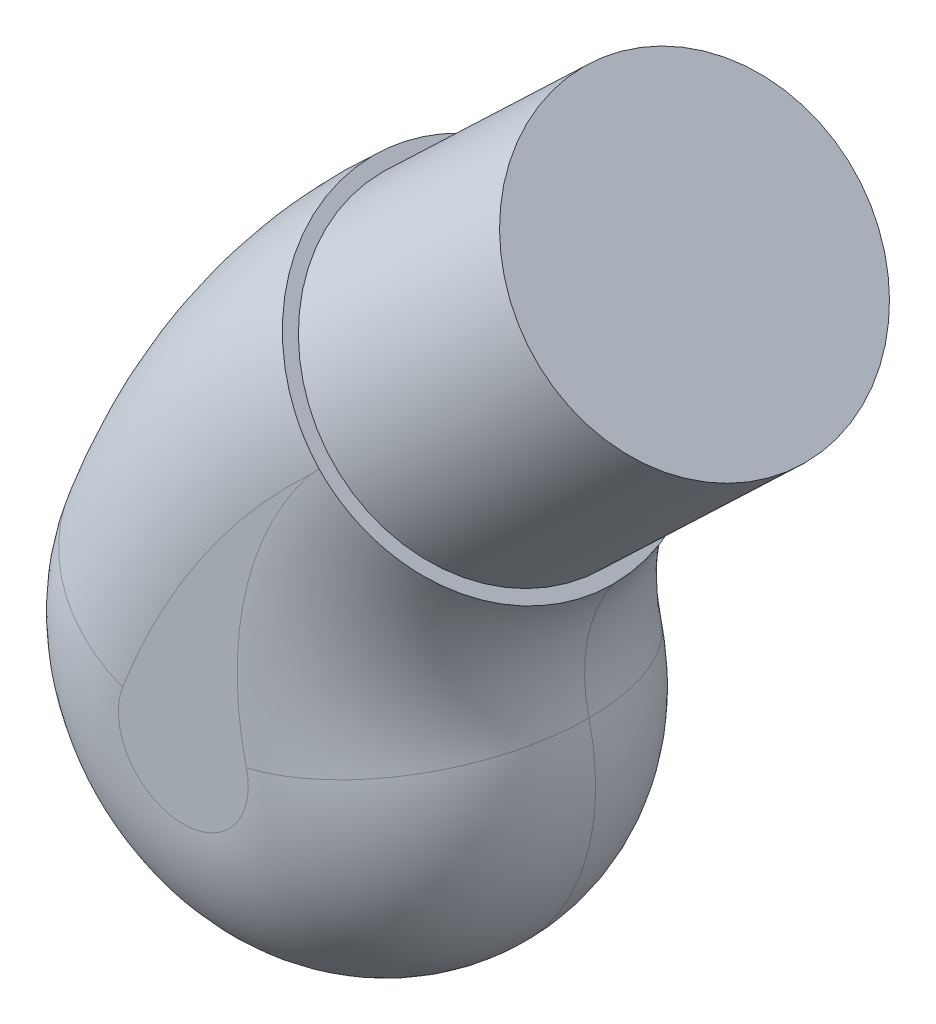
ISO-10303-21;
HEADER;
FILE_DESCRIPTION(('STEP AP214'),'2;1');
FILE_NAME('part.step','',(''),(''),'','','');
FILE_SCHEMA(('AUTOMOTIVE_DESIGN { 1 0 10303 214 1 1 1 1 }'));
ENDSEC;
DATA;
#1=APPLICATION_CONTEXT('core data for automotive mechanical design processes');
#2=APPLICATION_PROTOCOL_DEFINITION('international standard','automotive_design',2000,#1);
#3=PRODUCT_CONTEXT('',#1,'mechanical');
#4=PRODUCT('Part','Part','',(#3));
#5=PRODUCT_RELATED_PRODUCT_CATEGORY('part','',(#4));
#6=PRODUCT_DEFINITION_FORMATION('','',#4);
#7=PRODUCT_DEFINITION_CONTEXT('part definition',#1,'design');
#8=PRODUCT_DEFINITION('design','',#6,#7);
#9=PRODUCT_DEFINITION_SHAPE('','',#8);
#10=(LENGTH_UNIT() NAMED_UNIT(*) SI_UNIT(.MILLI.,.METRE.));
#11=(NAMED_UNIT(*) PLANE_ANGLE_UNIT() SI_UNIT($,.RADIAN.));
#12=(NAMED_UNIT(*) SI_UNIT($,.STERADIAN.) SOLID_ANGLE_UNIT());
#13=UNCERTAINTY_MEASURE_WITH_UNIT(LENGTH_MEASURE(1.E-05),#10,'distance_accuracy_value','');
#14=(GEOMETRIC_REPRESENTATION_CONTEXT(3) GLOBAL_UNCERTAINTY_ASSIGNED_CONTEXT((#13)) GLOBAL_UNIT_ASSIGNED_CONTEXT((#10,
#11,#12)) REPRESENTATION_CONTEXT('',''));
#15=CARTESIAN_POINT('',(0.,0.,0.));
#16=DIRECTION('',(0.,0.,1.));
#17=DIRECTION('',(1.,0.,0.));
#18=AXIS2_PLACEMENT_3D('',#15,#16,#17);
#19=CARTESIAN_POINT('',(16.2818360304692,15.5174485695616,25.));
#20=DIRECTION('',(-0.723895020546298,-0.689910138516804,0.));
#21=DIRECTION('',(0.689910138516804,-0.723895020546298,0.));
#22=AXIS2_PLACEMENT_3D('',#19,#20,#21);
#23=PLANE('',#22);
#24=CARTESIAN_POINT('',(9.82098882165332,22.2965562560012,12.5067721232087));
#25=DIRECTION('',(0.723895020546299,0.689910138516802,0.));
#26=DIRECTION('',(-0.689910138516802,0.723895020546299,0.));
#27=AXIS2_PLACEMENT_3D('',#24,#25,#26);
#28=CIRCLE('',#27,11.55);
#29=CARTESIAN_POINT('',(1.85252672178424,30.657543743311,12.5067721232087));
#30=VERTEX_POINT('',#29);
#31=EDGE_CURVE('E198',#30,#30,#28,.T.);
#32=ORIENTED_EDGE('',*,*,#31,.F.);
#33=EDGE_LOOP('',(#32));
#34=FACE_BOUND('',#33,.T.);
#35=CARTESIAN_POINT('',(1.19158226458532,31.3510462369153,12.5));
#36=CARTESIAN_POINT('',(1.19155614907585,31.3510736388713,12.8514823013509));
#37=CARTESIAN_POINT('',(1.20181211088013,31.3403124697472,13.202959132981));
#38=CARTESIAN_POINT('',(1.24269955032809,31.2974109204485,13.903397714343));
#39=CARTESIAN_POINT('',(1.27333004195232,31.2652715748645,14.2523595849596));
#40=CARTESIAN_POINT('',(1.35474900996919,31.1798419192689,14.9450525040614));
#41=CARTESIAN_POINT('',(1.40552315273876,31.1265666489526,15.2887870919281));
#42=CARTESIAN_POINT('',(1.52685946361283,30.9992533274786,15.9688338039355));
#43=CARTESIAN_POINT('',(1.59742139313367,30.925215526657,16.305146017516));
#44=CARTESIAN_POINT('',(1.75787134724203,30.7568618290644,16.9681184250444));
#45=CARTESIAN_POINT('',(1.84776840669457,30.6625364523721,17.2947740252332));
#46=CARTESIAN_POINT('',(2.04622846562591,30.4543002772282,17.935946757779));
#47=CARTESIAN_POINT('',(2.15479147027562,30.3403894733511,18.2504638867734));
#48=CARTESIAN_POINT('',(2.38978800229275,30.0938170432972,18.8650649451287));
#49=CARTESIAN_POINT('',(2.51621807660243,29.9611590402755,19.1651516483842));
#50=CARTESIAN_POINT('',(2.78606435778774,29.6780201670261,19.7488241339687));
#51=CARTESIAN_POINT('',(2.9294804891943,29.5275393759851,20.0324099896026));
#52=CARTESIAN_POINT('',(3.2323009594664,29.2098020094627,20.5811081361));
#53=CARTESIAN_POINT('',(3.39170759126694,29.0425430280966,20.8462177683284));
#54=CARTESIAN_POINT('',(3.72535822072233,28.6924568128336,21.3560369499197));
#55=CARTESIAN_POINT('',(3.89960224502604,28.5096295509752,21.6007464626412));
#56=CARTESIAN_POINT('',(4.26171591122329,28.129678213551,22.0680638931586));
#57=CARTESIAN_POINT('',(4.44958762738752,27.9325519615363,22.29066843409));
#58=CARTESIAN_POINT('',(4.83759700942788,27.525429288737,22.7121538501087));
#59=CARTESIAN_POINT('',(5.03773467259551,27.3154328707944,22.9110347304344));
#60=CARTESIAN_POINT('',(5.44890582943969,26.8840074772328,23.2837101801678));
#61=CARTESIAN_POINT('',(5.65994210155907,26.6625755863052,23.4574983092501));
#62=CARTESIAN_POINT('',(6.09136266906898,26.209903298791,23.7786951450759));
#63=CARTESIAN_POINT('',(6.31174696652372,25.9786629000384,23.9261038459943));
#64=CARTESIAN_POINT('',(6.7602828637288,25.5080321839555,24.1934887434901));
#65=CARTESIAN_POINT('',(6.98843397662488,25.2686423774618,24.3134666559117));
#66=CARTESIAN_POINT('',(7.45089543988643,24.7834001237832,24.5251523027231));
#67=CARTESIAN_POINT('',(7.68520579135669,24.5375476754391,24.616860032042));
#68=CARTESIAN_POINT('',(8.15841588232898,24.0410273180727,24.771387505279));
#69=CARTESIAN_POINT('',(8.39731741712986,23.7903575253153,24.8341956988477));
#70=CARTESIAN_POINT('',(8.87792107186252,23.2860793982171,24.9304262399403));
#71=CARTESIAN_POINT('',(9.11962319262679,23.0324710630027,24.963848578729));
#72=CARTESIAN_POINT('',(9.60411637431156,22.52411181137,25.0010725187806));
#73=CARTESIAN_POINT('',(9.84690746083831,22.269360868084,25.0048734198244));
#74=CARTESIAN_POINT('',(10.3318480915969,21.7605321260953,24.982827385257));
#75=CARTESIAN_POINT('',(10.5739976357063,21.5064543275212,24.9569804439896));
#76=CARTESIAN_POINT('',(11.0560138002737,21.0006941105409,24.8758102905274));
#77=CARTESIAN_POINT('',(11.2958796506868,20.7490125001119,24.8204774708853));
#78=CARTESIAN_POINT('',(11.7715435032884,20.2499175091434,24.6807234759513));
#79=CARTESIAN_POINT('',(12.0073415044424,20.0025041296892,24.5963022932622));
#80=CARTESIAN_POINT('',(12.4731949430107,19.5137028124497,24.3989710309027));
#81=CARTESIAN_POINT('',(12.7032503503597,19.2723149062105,24.2860608021129));
#82=CARTESIAN_POINT('',(13.1559819733324,18.7972817834645,24.0325534571535));
#83=CARTESIAN_POINT('',(13.3786581892267,18.5636365666737,23.8919563419998));
#84=CARTESIAN_POINT('',(13.8150843421415,18.1057121192805,23.5840476302819));
#85=CARTESIAN_POINT('',(14.0288327953895,17.8814344455412,23.416731615213));
#86=CARTESIAN_POINT('',(14.445843558834,17.4438817871317,23.0565893872942));
#87=CARTESIAN_POINT('',(14.649105862398,17.2306068094208,22.8637631583092));
#88=CARTESIAN_POINT('',(15.0436808781706,16.8165950806414,22.4539863590969));
#89=CARTESIAN_POINT('',(15.2349945755217,16.6158572959025,22.2370377818282));
#90=CARTESIAN_POINT('',(15.6043275854488,16.2283309908327,21.7805439888965));
#91=CARTESIAN_POINT('',(15.7823469332807,16.0415424335092,21.5409988331625));
#92=CARTESIAN_POINT('',(16.1237467428299,15.6833253145676,21.0411239866061));
#93=CARTESIAN_POINT('',(16.2871336919633,15.5118899459641,20.7808036044664));
#94=CARTESIAN_POINT('',(16.5981946880996,15.185506126365,20.2411306993917));
#95=CARTESIAN_POINT('',(16.7458685904034,15.0305578271964,19.9617780012299));
#96=CARTESIAN_POINT('',(17.0245138450769,14.7381865441904,19.3858908340159));
#97=CARTESIAN_POINT('',(17.1554772904137,14.6007718568853,19.0893483269162));
#98=CARTESIAN_POINT('',(17.3996792278314,14.3445405643804,18.4813218489858));
#99=CARTESIAN_POINT('',(17.5129183883525,14.225723257813,18.169838442204));
#100=CARTESIAN_POINT('',(17.7208873354223,14.0075097879606,17.5340771954524));
#101=CARTESIAN_POINT('',(17.8156135658658,13.9081173559541,17.2097969117107));
#102=CARTESIAN_POINT('',(17.9858501071591,13.7294949851883,16.5508067800394));
#103=CARTESIAN_POINT('',(18.0613606384591,13.6502648151195,16.2160970518099));
#104=CARTESIAN_POINT('',(18.1925093830334,13.512655700761,15.5392465197758));
#105=CARTESIAN_POINT('',(18.24818226595,13.454240379007,15.1971197999665));
#106=CARTESIAN_POINT('',(18.3394186488853,13.3585097039345,14.5074305107202));
#107=CARTESIAN_POINT('',(18.3749941328834,13.3211817763075,14.159871307991));
#108=CARTESIAN_POINT('',(18.4095033462526,13.2849726436592,13.6859433008726));
#109=CARTESIAN_POINT('',(18.4172977061036,13.2767943346745,13.5608326640299));
#110=CARTESIAN_POINT('',(18.4302718813521,13.263181053272,13.3104729400395));
#111=CARTESIAN_POINT('',(18.435454721388,13.2577429072225,13.1852241822156));
#112=CARTESIAN_POINT('',(18.4393357275054,13.2536707232579,13.05987665076));
#113=B_SPLINE_CURVE_WITH_KNOTS('',3,(#35,#36,#37,#38,#39,#40,#41,#42,#43,#44,#45,#46,#47,#48,
#49,#50,#51,#52,#53,#54,#55,#56,#57,#58,#59,#60,#61,#62,#63,#64,#65,#66,#67,#68,#69,#70,#71,#72,
#73,#74,#75,#76,#77,#78,#79,#80,#81,#82,#83,#84,#85,#86,#87,#88,#89,#90,#91,#92,#93,#94,#95,#96,
#97,#98,#99,#100,#101,#102,#103,#104,#105,#106,#107,#108,#109,#110,#111,#112),.UNSPECIFIED.,.F.,
.F.,(4,2,2,2,2,2,2,2,2,2,2,2,2,2,2,2,2,2,2,2,2,2,2,2,2,2,2,2,2,2,2,2,2,2,2,2,2,2,4),(0.,
1.05412495344784,2.10819889653658,3.16152413337613,4.21483667069503,5.26864247040714,
6.3224485620492,7.37605126893912,8.42964929484609,9.48339861649045,10.537149830773,
11.5910617744351,12.6449734853792,13.6991552151206,14.7533371776452,15.8074531811747,
16.8615693737814,17.9161065024625,18.9706439446195,20.0252063148444,21.0797688862644,
22.1346752783751,23.1895819387524,24.2444941209111,25.2994062643596,26.3544930396395,
27.4095804822577,28.4645808195372,29.5195783589074,30.5741058149899,31.6286429812125,
32.683677296012,33.7386718124501,34.793868781553,35.8490536444759,36.9023852426792,
37.9550880796935,38.3319041947086,38.7082828757795),.UNSPECIFIED.);
#114=CARTESIAN_POINT('',(1.19158226458532,31.3510462369153,12.5));
#115=VERTEX_POINT('',#114);
#116=CARTESIAN_POINT('',(9.77636140606287,22.3433820121723,24.9998489996241));
#117=VERTEX_POINT('',#116);
#118=EDGE_CURVE('E163',#115,#117,#113,.T.);
#119=ORIENTED_EDGE('',*,*,#118,.T.);
#120=CARTESIAN_POINT('',(1.19158226458532,31.3510462369153,14.4608128362231));
#121=CARTESIAN_POINT('',(1.22963312058225,31.3111210007927,14.8076279329357));
#122=CARTESIAN_POINT('',(1.27783549803078,31.2605441806165,15.1520954516926));
#123=CARTESIAN_POINT('',(1.39408198325015,31.1385714089346,15.8339050022062));
#124=CARTESIAN_POINT('',(1.4621250472861,31.0671765525781,16.1712474077842));
#125=CARTESIAN_POINT('',(1.61753648751098,30.9041095653954,16.8361600891158));
#126=CARTESIAN_POINT('',(1.70489010570087,30.8124529195454,17.1637376118315));
#127=CARTESIAN_POINT('',(1.89831778170809,30.6094970218418,17.8070622881988));
#128=CARTESIAN_POINT('',(2.00439163088618,30.498197988905,18.1228095736523));
#129=CARTESIAN_POINT('',(2.23455499230695,30.2566968107909,18.740375682363));
#130=CARTESIAN_POINT('',(2.35865252328182,30.1264862518797,19.0421882268762));
#131=CARTESIAN_POINT('',(2.62393941602325,29.8481313619449,19.6295960305236));
#132=CARTESIAN_POINT('',(2.76512879993069,29.6999870076898,19.9151912686493));
#133=CARTESIAN_POINT('',(3.06356285370042,29.3868521319656,20.4680934550989));
#134=CARTESIAN_POINT('',(3.22080460050984,29.2218646775385,20.7354037182702));
#135=CARTESIAN_POINT('',(3.5502414199839,28.8761998439783,21.2499059539985));
#136=CARTESIAN_POINT('',(3.72243643763683,28.6955225225669,21.4970980005621));
#137=CARTESIAN_POINT('',(4.08072918105483,28.3195803260719,21.9698587122783));
#138=CARTESIAN_POINT('',(4.26684043061309,28.1243012610149,22.1954058439583));
#139=CARTESIAN_POINT('',(4.65148896456746,27.7207049912332,22.6230166518878));
#140=CARTESIAN_POINT('',(4.85002627403176,27.5123877602053,22.8250802807595));
#141=CARTESIAN_POINT('',(5.25814398379019,27.0841662261284,23.2043392051764));
#142=CARTESIAN_POINT('',(5.46772605768128,26.8642601670412,23.3815307168968));
#143=CARTESIAN_POINT('',(5.89641571424266,26.414453314787,23.7097762298627));
#144=CARTESIAN_POINT('',(6.11552330900223,26.1845525089352,23.8608301979346));
#145=CARTESIAN_POINT('',(6.56222209857735,25.7158493961608,24.1360727603708));
#146=CARTESIAN_POINT('',(6.78983160559293,25.4770278749815,24.2601989164267));
#147=CARTESIAN_POINT('',(7.25144058206897,24.9926801014746,24.4802926299959));
#148=CARTESIAN_POINT('',(7.48544005916671,24.7471538411334,24.5762601538523));
#149=CARTESIAN_POINT('',(7.95815907470119,24.2511487495158,24.7393836555708));
#150=CARTESIAN_POINT('',(8.1968783927472,24.0006701494865,24.8065409754034));
#151=CARTESIAN_POINT('',(8.67736080620213,23.4965192359953,24.911608696418));
#152=CARTESIAN_POINT('',(8.91912390876368,23.2428469150284,24.9495190288589));
#153=CARTESIAN_POINT('',(9.40485472445677,22.7331890637,24.9959418286602));
#154=CARTESIAN_POINT('',(9.648827222487,22.4771985127364,25.0043491288229));
#155=CARTESIAN_POINT('',(10.136397545968,21.9656105397102,24.9914485439027));
#156=CARTESIAN_POINT('',(10.3799953706506,21.7100131184536,24.9701405979838));
#157=CARTESIAN_POINT('',(10.8651050673945,21.2010069823116,24.8979944651177));
#158=CARTESIAN_POINT('',(11.1066168970682,20.9475983119018,24.847155679528));
#159=CARTESIAN_POINT('',(11.5858544416547,20.4447535893545,24.7163395116606));
#160=CARTESIAN_POINT('',(11.8235801454401,20.1953175488927,24.63636204376));
#161=CARTESIAN_POINT('',(12.2946409978582,19.7010523012869,24.4474364641707));
#162=CARTESIAN_POINT('',(12.5279515534988,19.4562488985826,24.3383595109169));
#163=CARTESIAN_POINT('',(12.9874312784763,18.974135263221,24.0921999581167));
#164=CARTESIAN_POINT('',(13.2136004245562,18.7368250549663,23.9551172673769));
#165=CARTESIAN_POINT('',(13.6572219578149,18.2713507837467,23.6539236505601));
#166=CARTESIAN_POINT('',(13.8746737673915,18.0431873268366,23.4898109371682));
#167=CARTESIAN_POINT('',(14.2993161745179,17.5976270909884,23.1357308529824));
#168=CARTESIAN_POINT('',(14.5065067527111,17.3802303323605,22.9457634334191));
#169=CARTESIAN_POINT('',(14.9099525295986,16.9569108699488,22.5405208181359));
#170=CARTESIAN_POINT('',(15.1061619084207,16.7510362431181,22.3251497725357));
#171=CARTESIAN_POINT('',(15.4853660106244,16.3531525970739,21.8712111557262));
#172=CARTESIAN_POINT('',(15.6683606557412,16.1611436599803,21.6326434471533));
#173=CARTESIAN_POINT('',(16.0198112390089,15.7923806675382,21.1339812655644));
#174=CARTESIAN_POINT('',(16.1882672687107,15.6156265161291,20.8738869281238));
#175=CARTESIAN_POINT('',(16.5094029282019,15.2786717565928,20.3339850838045));
#176=CARTESIAN_POINT('',(16.6620827285437,15.118470969512,20.0541777900919));
#177=CARTESIAN_POINT('',(16.9503153208172,14.8160400779259,19.4772094970351));
#178=CARTESIAN_POINT('',(17.0858921213738,14.673784782134,19.1800736999561));
#179=CARTESIAN_POINT('',(17.3391228398796,14.4080799519806,18.5701688355739));
#180=CARTESIAN_POINT('',(17.4567770609954,14.2846300995185,18.2574000328273));
#181=CARTESIAN_POINT('',(17.6731929689844,14.0575535725711,17.6185264393359));
#182=CARTESIAN_POINT('',(17.7719598282548,13.9539214708969,17.2924253294878));
#183=CARTESIAN_POINT('',(17.9498100326706,13.7673103889717,16.6291625235563));
#184=CARTESIAN_POINT('',(18.0288961037257,13.6843285485332,16.2920023665484));
#185=CARTESIAN_POINT('',(18.1542653171733,13.552783664239,15.6707586919948));
#186=CARTESIAN_POINT('',(18.2038928867224,13.5007114471882,15.3880819048889));
#187=CARTESIAN_POINT('',(18.2891853678616,13.4112174697271,14.8183654142482));
#188=CARTESIAN_POINT('',(18.3248522893102,13.3737936004527,14.5313263449193));
#189=CARTESIAN_POINT('',(18.3820004033152,13.3138303779223,13.9543420280172));
#190=CARTESIAN_POINT('',(18.403483705482,13.2912888111367,13.6643972191466));
#191=CARTESIAN_POINT('',(18.4321606602322,13.2611992333945,13.0829704830006));
#192=CARTESIAN_POINT('',(18.4393515189933,13.2536541538834,12.7914882663624));
#193=CARTESIAN_POINT('',(18.4393357275054,13.2536707232579,12.5));
#194=B_SPLINE_CURVE_WITH_KNOTS('',3,(#120,#121,#122,#123,#124,#125,#126,#127,#128,#129,#130,
#131,#132,#133,#134,#135,#136,#137,#138,#139,#140,#141,#142,#143,#144,#145,#146,#147,#148,#149,
#150,#151,#152,#153,#154,#155,#156,#157,#158,#159,#160,#161,#162,#163,#164,#165,#166,#167,#168,
#169,#170,#171,#172,#173,#174,#175,#176,#177,#178,#179,#180,#181,#182,#183,#184,#185,#186,#187,
#188,#189,#190,#191,#192,#193),.UNSPECIFIED.,.F.,.F.,(4,2,2,2,2,2,2,2,2,2,2,2,2,2,2,2,2,2,2,2,2,
2,2,2,2,2,2,2,2,2,2,2,2,2,2,2,4),(0.,1.05319682864208,2.10633826303122,3.15867760463274,
4.21100521852615,5.26380245510958,6.31660105550673,7.36920828748659,8.42181164718571,
9.47545156460011,10.5290936076834,11.5828957692593,12.6366992683044,13.6929207366826,
14.7491434675114,15.8053169944599,16.8614930037883,17.9214300797273,18.9813693256796,
20.0413300592353,21.1012939074681,22.1660310903261,23.230771740275,24.2955828226955,
25.3603959136881,26.4293635168191,27.4983374504288,28.5673046521252,29.6362602963202,
30.7036982708974,31.771118187378,32.8382453657071,33.9052246580217,34.7795784147395,
35.6538062479075,36.5279040228859,37.4021726457481),.UNSPECIFIED.);
#195=CARTESIAN_POINT('',(18.4393357275054,13.2536707232579,12.5));
#196=VERTEX_POINT('',#195);
#197=EDGE_CURVE('E127',#117,#196,#194,.T.);
#198=ORIENTED_EDGE('',*,*,#197,.T.);
#199=CARTESIAN_POINT('',(18.4393357275054,13.2536707232579,12.5));
#200=CARTESIAN_POINT('',(18.4393679372597,13.2536369268553,12.1525684663161));
#201=CARTESIAN_POINT('',(18.4291427961295,13.2643657570831,11.8051477113368));
#202=CARTESIAN_POINT('',(18.3884136224962,13.3071012444141,11.1128534254182));
#203=CARTESIAN_POINT('',(18.3579120591671,13.3391053107122,10.767979589496));
#204=CARTESIAN_POINT('',(18.2769233115255,13.4240835533338,10.083705373054));
#205=CARTESIAN_POINT('',(18.2264645797861,13.4770278755144,9.74429791305932));
#206=CARTESIAN_POINT('',(18.1060065391726,13.6034196632511,9.07285023198808));
#207=CARTESIAN_POINT('',(18.0360071388313,13.6768672247803,8.74081004540467));
#208=CARTESIAN_POINT('',(17.8770441132115,13.8436607479839,8.08638564000919));
#209=CARTESIAN_POINT('',(17.7880791431626,13.9370081206721,7.76400210776037));
#210=CARTESIAN_POINT('',(17.5919023260516,14.142848581806,7.13111703928463));
#211=CARTESIAN_POINT('',(17.4846902154165,14.2553419468084,6.82061567477047));
#212=CARTESIAN_POINT('',(17.2528421520192,14.4986108150953,6.21357766823182));
#213=CARTESIAN_POINT('',(17.1282053094822,14.6293872519847,5.91704174037141));
#214=CARTESIAN_POINT('',(16.8624402844391,14.908243826955,5.33992773157713));
#215=CARTESIAN_POINT('',(16.7213119968434,15.0563240753021,5.05934975235002));
#216=CARTESIAN_POINT('',(16.4215854599097,15.3708151017398,4.51236635712545));
#217=CARTESIAN_POINT('',(16.2627784582962,15.5374449152152,4.24620122737484));
#218=CARTESIAN_POINT('',(15.9304193015582,15.8861760399858,3.73397140970524));
#219=CARTESIAN_POINT('',(15.7568670132248,16.0682774910517,3.4879069034147));
#220=CARTESIAN_POINT('',(15.396220960537,16.4466889205194,3.01751599273859));
#221=CARTESIAN_POINT('',(15.2091252694495,16.6430009205648,2.79319269199391));
#222=CARTESIAN_POINT('',(14.8227219713781,17.0484383939116,2.36785380008164));
#223=CARTESIAN_POINT('',(14.6234142974186,17.2575639374876,2.16683833676114));
#224=CARTESIAN_POINT('',(14.2114557608266,17.6898154970191,1.78718146239472));
#225=CARTESIAN_POINT('',(13.9986712497022,17.9130817449736,1.60884463097857));
#226=CARTESIAN_POINT('',(13.5635082121835,18.3696808560734,1.27873714409891));
#227=CARTESIAN_POINT('',(13.3411295995799,18.6030138096749,1.12696672741446));
#228=CARTESIAN_POINT('',(12.8883575443442,19.0780893563718,0.851088817572766));
#229=CARTESIAN_POINT('',(12.657964360019,19.3198316784363,0.726980433831228));
#230=CARTESIAN_POINT('',(12.1907861128835,19.8100230641376,0.507325860271062));
#231=CARTESIAN_POINT('',(11.954001063349,20.0584721138448,0.411779611134693));
#232=CARTESIAN_POINT('',(11.4754302131114,20.5606173007677,0.249861756377551));
#233=CARTESIAN_POINT('',(11.2336387722289,20.8143193559975,0.183525166922723));
#234=CARTESIAN_POINT('',(10.7470524292821,21.3248748777388,0.0807015781429287));
#235=CARTESIAN_POINT('',(10.5022575210911,21.5817283506787,0.0442146397176756));
#236=CARTESIAN_POINT('',(10.0114172270143,22.0967473726191,0.0013880543374006));
#237=CARTESIAN_POINT('',(9.76537185226245,22.3549129099371,-0.00495186057533866));
#238=CARTESIAN_POINT('',(9.27379468395401,22.8707051044362,0.0125968815293924));
#239=CARTESIAN_POINT('',(9.02826288848736,23.1283317636214,0.0364854259224638));
#240=CARTESIAN_POINT('',(8.54046055929187,23.6401631709329,0.114198143220243));
#241=CARTESIAN_POINT('',(8.29818090085926,23.8943774932446,0.167902001498461));
#242=CARTESIAN_POINT('',(7.81762138605429,24.3986093060881,0.304809713667848));
#243=CARTESIAN_POINT('',(7.57934152182879,24.6486268048599,0.388013509632179));
#244=CARTESIAN_POINT('',(7.10848977799699,25.1426726432181,0.583357563219642));
#245=CARTESIAN_POINT('',(6.8759180245904,25.3867008503883,0.695498459978585));
#246=CARTESIAN_POINT('',(6.41816558057074,25.8670021191609,0.94793816269134));
#247=CARTESIAN_POINT('',(6.19298486616554,26.1032752057276,1.08823687799337));
#248=CARTESIAN_POINT('',(5.75263204975267,26.5653197435425,1.39531701450698));
#249=CARTESIAN_POINT('',(5.5374196206914,26.7911335083496,1.56197694979129));
#250=CARTESIAN_POINT('',(5.1174786125394,27.2317607549328,1.92105744405334));
#251=CARTESIAN_POINT('',(4.91275002146667,27.4465742492809,2.11347797358841));
#252=CARTESIAN_POINT('',(4.51526760522242,27.863636596694,2.5227033775691));
#253=CARTESIAN_POINT('',(4.32251274820611,28.0658865324323,2.73950614632058));
#254=CARTESIAN_POINT('',(3.95034963412969,28.4563823522069,3.19597015403526));
#255=CARTESIAN_POINT('',(3.77094125675984,28.6446283624794,3.43563118690179));
#256=CARTESIAN_POINT('',(3.42735063412103,29.0051442136732,3.935254563248));
#257=CARTESIAN_POINT('',(3.26311869266086,29.1774661988136,4.19514510974994));
#258=CARTESIAN_POINT('',(2.95037072792042,29.5056200868667,4.73410041589955));
#259=CARTESIAN_POINT('',(2.80185511056662,29.6614515638572,5.0131656704911));
#260=CARTESIAN_POINT('',(2.52162246969408,29.9554884274961,5.58845769103546));
#261=CARTESIAN_POINT('',(2.3899044415055,30.0936948683043,5.88468342907098));
#262=CARTESIAN_POINT('',(2.14421320601066,30.3514888215124,6.49218536889043));
#263=CARTESIAN_POINT('',(2.03023808124605,30.4710783458244,6.80345993959012));
#264=CARTESIAN_POINT('',(1.83649937769765,30.6743605922446,7.39132918321441));
#265=CARTESIAN_POINT('',(1.75416855294711,30.7607470225158,7.66615463341113));
#266=CARTESIAN_POINT('',(1.60335709905028,30.9189874286533,8.22365195634443));
#267=CARTESIAN_POINT('',(1.53487489398015,30.9908430580732,8.50632293211993));
#268=CARTESIAN_POINT('',(1.41214285189247,31.1196208642955,9.07793990446745));
#269=CARTESIAN_POINT('',(1.35788657503851,31.1765497981599,9.36688299739402));
#270=CARTESIAN_POINT('',(1.26382499083111,31.2752448435448,9.94971177664054));
#271=CARTESIAN_POINT('',(1.22402171308351,31.3170088254814,10.2435981510773));
#272=CARTESIAN_POINT('',(1.19158226458532,31.3510462369153,10.5391871637769));
#273=B_SPLINE_CURVE_WITH_KNOTS('',3,(#199,#200,#201,#202,#203,#204,#205,#206,#207,#208,#209,
#210,#211,#212,#213,#214,#215,#216,#217,#218,#219,#220,#221,#222,#223,#224,#225,#226,#227,#228,
#229,#230,#231,#232,#233,#234,#235,#236,#237,#238,#239,#240,#241,#242,#243,#244,#245,#246,#247,
#248,#249,#250,#251,#252,#253,#254,#255,#256,#257,#258,#259,#260,#261,#262,#263,#264,#265,#266,
#267,#268,#269,#270,#271,#272),.UNSPECIFIED.,.F.,.F.,(4,2,2,2,2,2,2,2,2,2,2,2,2,2,2,2,2,2,2,2,2,
2,2,2,2,2,2,2,2,2,2,2,2,2,2,2,4),(0.,1.041962396169,2.08379792996248,3.12415346103015,
4.16451386194755,5.2049480550845,6.2453972781734,7.28589965007693,8.32640865280005,
9.38086015562246,10.4353211853731,11.4899325224664,12.5445496439932,13.6120986734173,
14.6796572974843,15.7471815463366,16.8147035781428,17.8835018805711,18.9523023635726,
20.0210933466686,21.089880347703,22.1543854639573,23.2188884899335,24.2834150296768,
25.3479381423193,26.4076911340493,27.4674429145606,28.5271032431764,29.5867540184933,
30.6428018826005,31.6988770160103,32.7548889555325,33.8107866935264,34.7088855489713,
35.6068821463656,36.5044715313455,37.4021869143106),.UNSPECIFIED.);
#274=CARTESIAN_POINT('',(9.77636140606292,22.3433820121722,0.000151000375869332));
#275=VERTEX_POINT('',#274);
#276=EDGE_CURVE('E155',#196,#275,#273,.T.);
#277=ORIENTED_EDGE('',*,*,#276,.T.);
#278=CARTESIAN_POINT('',(18.4393357275054,13.2536707232579,11.94012334924));
#279=CARTESIAN_POINT('',(18.4284944676654,13.2650460221214,11.5890744612896));
#280=CARTESIAN_POINT('',(18.4073811147155,13.2871994160407,11.2386993101655));
#281=CARTESIAN_POINT('',(18.3448775946649,13.352781851209,10.5417866271086));
#282=CARTESIAN_POINT('',(18.3034884476609,13.3962098221116,10.1952489030077));
#283=CARTESIAN_POINT('',(18.2007371077466,13.5040226794183,9.50871622885647));
#284=CARTESIAN_POINT('',(18.1393895259973,13.5683922349177,9.1687166846051));
#285=CARTESIAN_POINT('',(17.9971604408583,13.7176275059493,8.49741748931225));
#286=CARTESIAN_POINT('',(17.9162791645745,13.8024929831884,8.16611773717337));
#287=CARTESIAN_POINT('',(17.7355162140396,13.9921602927206,7.51441704876799));
#288=CARTESIAN_POINT('',(17.6356258537195,14.0969712389573,7.1940211741586));
#289=CARTESIAN_POINT('',(17.4175825900606,14.3257552848994,6.56656260555516));
#290=CARTESIAN_POINT('',(17.2994296744976,14.4497283974311,6.25949992048597));
#291=CARTESIAN_POINT('',(17.0457277507463,14.715927644338,5.66094291346942));
#292=CARTESIAN_POINT('',(16.9101819937012,14.8581503674191,5.36944569634365));
#293=CARTESIAN_POINT('',(16.6226434458778,15.1598530260175,4.80402555892429));
#294=CARTESIAN_POINT('',(16.4706507231448,15.3193328901375,4.53010256592913));
#295=CARTESIAN_POINT('',(16.1512237839642,15.6544947580269,4.00164510922312));
#296=CARTESIAN_POINT('',(15.9837822963696,15.8301843911191,3.74711987927379));
#297=CARTESIAN_POINT('',(15.6347101784225,16.196451755354,3.25940506104717));
#298=CARTESIAN_POINT('',(15.4530795199539,16.3870295159978,3.02621551504899));
#299=CARTESIAN_POINT('',(15.0768919180214,16.7817480693671,2.58279062420639));
#300=CARTESIAN_POINT('',(14.8823329977328,16.9858909362955,2.37255880281563));
#301=CARTESIAN_POINT('',(14.4816966255971,17.4062626030494,1.97657992301083));
#302=CARTESIAN_POINT('',(14.2756191737322,17.6224914028936,1.79083286463487));
#303=CARTESIAN_POINT('',(13.8532736180893,18.0656416446585,1.44502808661273));
#304=CARTESIAN_POINT('',(13.636999049561,18.2925698697822,1.28498695512156));
#305=CARTESIAN_POINT('',(13.1959194976519,18.7553769419876,0.991873619178664));
#306=CARTESIAN_POINT('',(12.9711145098804,18.9912557936763,0.858801428608712));
#307=CARTESIAN_POINT('',(12.5145858326179,19.4702730131035,0.62057757414059));
#308=CARTESIAN_POINT('',(12.2828625720039,19.7134109308384,0.515424183483653));
#309=CARTESIAN_POINT('',(11.8141302242141,20.2052329719865,0.333773495451645));
#310=CARTESIAN_POINT('',(11.5771211367468,20.4539170957052,0.25727619965574));
#311=CARTESIAN_POINT('',(11.0994092199377,20.9551610382529,0.133457559932921));
#312=CARTESIAN_POINT('',(10.8587050128426,21.2077223027029,0.0861473834441182));
#313=CARTESIAN_POINT('',(10.3754025186261,21.7148322137604,0.0210861545409315));
#314=CARTESIAN_POINT('',(10.1328042308417,21.9693808610636,0.00333511247310873));
#315=CARTESIAN_POINT('',(9.64743292373479,22.4786614944604,-0.00248030601635474));
#316=CARTESIAN_POINT('',(9.40465990065151,22.7333934845001,0.00945597685274066));
#317=CARTESIAN_POINT('',(8.92067084141128,23.2412237806835,0.0629335858059693));
#318=CARTESIAN_POINT('',(8.67945480504473,23.4943220870471,0.104474907904692));
#319=CARTESIAN_POINT('',(8.20030820477233,23.9970713853753,0.216866368010261));
#320=CARTESIAN_POINT('',(7.96237746458555,24.2467225623045,0.287714927097899));
#321=CARTESIAN_POINT('',(7.49148067245671,24.7408156680329,0.458219357219408));
#322=CARTESIAN_POINT('',(7.25851462067285,24.9852575966662,0.557875229171309));
#323=CARTESIAN_POINT('',(6.79920420480246,25.4671935827765,0.785288382880253));
#324=CARTESIAN_POINT('',(6.57285986052003,25.704687619474,0.913045748673109));
#325=CARTESIAN_POINT('',(6.12840470022689,26.1710365820853,1.19575542998298));
#326=CARTESIAN_POINT('',(5.91029388172936,26.3998915106084,1.35070773728608));
#327=CARTESIAN_POINT('',(5.48391471007393,26.8472740637762,1.68666313952292));
#328=CARTESIAN_POINT('',(5.27564378787778,27.0658043840097,1.86765938431871));
#329=CARTESIAN_POINT('',(4.8703657402006,27.4910463746274,2.25444814123308));
#330=CARTESIAN_POINT('',(4.67335861830332,27.6977580412514,2.46024066124093));
#331=CARTESIAN_POINT('',(4.29202710818951,28.0978738910376,2.89514174855627));
#332=CARTESIAN_POINT('',(4.10770165958261,28.2912791868249,3.12424836245221));
#333=CARTESIAN_POINT('',(3.75302855151629,28.6634234452103,3.60416331422069));
#334=CARTESIAN_POINT('',(3.58268085522996,28.8421624464494,3.8549715949127));
#335=CARTESIAN_POINT('',(3.2572695973617,29.1836034197723,4.37635770885568));
#336=CARTESIAN_POINT('',(3.10219733378096,29.3463145225143,4.64692413164631));
#337=CARTESIAN_POINT('',(2.80832855332304,29.6546592401681,5.20603374890652));
#338=CARTESIAN_POINT('',(2.66953218370632,29.8002927005655,5.49457710599103));
#339=CARTESIAN_POINT('',(2.40914350171506,30.0735080945375,6.08772783239352));
#340=CARTESIAN_POINT('',(2.28755933735272,30.2010814787298,6.3923427167051));
#341=CARTESIAN_POINT('',(2.06254366129792,30.4371813971787,7.01533276862145));
#342=CARTESIAN_POINT('',(1.95911147161311,30.5457086428255,7.33370742173286));
#343=CARTESIAN_POINT('',(1.77108505245258,30.7429972184857,7.98212063594642));
#344=CARTESIAN_POINT('',(1.68650014365371,30.8317487686868,8.31216487502231));
#345=CARTESIAN_POINT('',(1.53683773494229,30.9887835278253,8.98141885434595));
#346=CARTESIAN_POINT('',(1.47176002125406,31.0570669610688,9.32062849410739));
#347=CARTESIAN_POINT('',(1.36167206593362,31.1725778344847,10.0051787927733));
#348=CARTESIAN_POINT('',(1.31662688190057,31.219841938316,10.3505076748497));
#349=CARTESIAN_POINT('',(1.24677747299156,31.2931321198548,11.045288949007));
#350=CARTESIAN_POINT('',(1.22196120592822,31.3191708329462,11.3947387620281));
#351=CARTESIAN_POINT('',(1.20208055026666,31.340030807072,11.870739020919));
#352=CARTESIAN_POINT('',(1.19814154212149,31.3441638502366,11.9966073111864));
#353=CARTESIAN_POINT('',(1.19289421962895,31.34966965514,12.2483124464887));
#354=CARTESIAN_POINT('',(1.1915828491718,31.3510456235322,12.3741491576553));
#355=CARTESIAN_POINT('',(1.19158226458532,31.3510462369153,12.5));
#356=B_SPLINE_CURVE_WITH_KNOTS('',3,(#278,#279,#280,#281,#282,#283,#284,#285,#286,#287,#288,
#289,#290,#291,#292,#293,#294,#295,#296,#297,#298,#299,#300,#301,#302,#303,#304,#305,#306,#307,
#308,#309,#310,#311,#312,#313,#314,#315,#316,#317,#318,#319,#320,#321,#322,#323,#324,#325,#326,
#327,#328,#329,#330,#331,#332,#333,#334,#335,#336,#337,#338,#339,#340,#341,#342,#343,#344,#345,
#346,#347,#348,#349,#350,#351,#352,#353,#354,#355),.UNSPECIFIED.,.F.,.F.,(4,2,2,2,2,2,2,2,2,2,2,
2,2,2,2,2,2,2,2,2,2,2,2,2,2,2,2,2,2,2,2,2,2,2,2,2,2,2,4),(0.,1.05387893173111,2.10770484714558,
3.16076100772694,4.2138049256751,5.26733118518026,6.32085814987701,7.37418847097391,
8.42751443434079,9.48133871216866,10.535165078225,11.5891529544189,12.643140832252,
13.6978061443426,14.7524719993014,15.8070726086917,16.8616732761984,17.9166772001994,
18.9716814934825,20.0267092163191,21.0817367971286,22.136707546023,23.1916783285371,
24.2466522659201,25.3016258846616,26.3563225272495,27.4110195054044,28.4656281866019,
29.520234089154,30.5742356941587,31.6282468347866,32.6827552726202,33.7372243152423,
34.7922136800671,35.847191483039,36.9003218185767,37.9528247713681,38.3307745248821,
38.708284443042),.UNSPECIFIED.);
#357=EDGE_CURVE('E184',#275,#115,#356,.T.);
#358=ORIENTED_EDGE('',*,*,#357,.T.);
#359=EDGE_LOOP('',(#119,#198,#277,#358));
#360=FACE_BOUND('',#359,.T.);
#361=ADVANCED_FACE('F55',(#34,#360),#23,.F.);
#362=CARTESIAN_POINT('',(0.,0.,0.));
#363=DIRECTION('',(0.,0.,1.));
#364=DIRECTION('',(1.,0.,0.));
#365=AXIS2_PLACEMENT_3D('',#362,#363,#364);
#366=PLANE('',#365);
#367=CARTESIAN_POINT('',(45.2723179295439,-17.272260647135,0.));
#368=DIRECTION('',(0.,0.,1.));
#369=DIRECTION('',(1.,0.,0.));
#370=AXIS2_PLACEMENT_3D('',#367,#368,#369);
#371=CIRCLE('',#370,53.1303072452392);
#372=CARTESIAN_POINT('',(-4.36793524531769,1.66645136580695,0.));
#373=VERTEX_POINT('',#372);
#374=CARTESIAN_POINT('',(9.15029554177823,21.6896315886287,0.));
#375=VERTEX_POINT('',#374);
#376=EDGE_CURVE('E120',#373,#375,#371,.F.);
#377=ORIENTED_EDGE('',*,*,#376,.T.);
#378=CARTESIAN_POINT('',(27.7918815252946,6.70882781288608,0.));
#379=DIRECTION('',(0.,0.,1.));
#380=DIRECTION('',(1.,0.,0.));
#381=AXIS2_PLACEMENT_3D('',#378,#379,#380);
#382=CIRCLE('',#381,23.915125125078);
#383=CARTESIAN_POINT('',(4.54449832622934,1.09702024812077,0.));
#384=VERTEX_POINT('',#383);
#385=EDGE_CURVE('E12',#375,#384,#382,.T.);
#386=ORIENTED_EDGE('',*,*,#385,.T.);
#387=CARTESIAN_POINT('',(0.,0.,0.));
#388=DIRECTION('',(0.,0.,1.));
#389=DIRECTION('',(1.,0.,0.));
#390=AXIS2_PLACEMENT_3D('',#387,#388,#389);
#391=CIRCLE('',#390,4.67503138619285);
#392=EDGE_CURVE('E65',#384,#373,#391,.F.);
#393=ORIENTED_EDGE('',*,*,#392,.T.);
#394=EDGE_LOOP('',(#377,#386,#393));
#395=FACE_BOUND('',#394,.T.);
#396=ADVANCED_FACE('F119',(#395),#366,.F.);
#397=CARTESIAN_POINT('',(0.,0.,25.));
#398=DIRECTION('',(0.,0.,1.));
#399=DIRECTION('',(1.,0.,0.));
#400=AXIS2_PLACEMENT_3D('',#397,#398,#399);
#401=PLANE('',#400);
#402=CARTESIAN_POINT('',(0.,0.,25.));
#403=DIRECTION('',(0.,0.,1.));
#404=DIRECTION('',(1.,0.,0.));
#405=AXIS2_PLACEMENT_3D('',#402,#403,#404);
#406=CIRCLE('',#405,4.67503138619285);
#407=CARTESIAN_POINT('',(-4.36793524531769,1.66645136580695,25.));
#408=VERTEX_POINT('',#407);
#409=CARTESIAN_POINT('',(4.54449832622934,1.09702024812077,25.));
#410=VERTEX_POINT('',#409);
#411=EDGE_CURVE('E133',#408,#410,#406,.T.);
#412=ORIENTED_EDGE('',*,*,#411,.T.);
#413=CARTESIAN_POINT('',(27.7918815252946,6.70882781288608,25.));
#414=DIRECTION('',(0.,0.,1.));
#415=DIRECTION('',(1.,0.,0.));
#416=AXIS2_PLACEMENT_3D('',#413,#414,#415);
#417=CIRCLE('',#416,23.915125125078);
#418=CARTESIAN_POINT('',(9.15029554177819,21.6896315886287,25.));
#419=VERTEX_POINT('',#418);
#420=EDGE_CURVE('E191',#410,#419,#417,.F.);
#421=ORIENTED_EDGE('',*,*,#420,.T.);
#422=CARTESIAN_POINT('',(45.2723179295439,-17.272260647135,25.));
#423=DIRECTION('',(0.,0.,1.));
#424=DIRECTION('',(1.,0.,0.));
#425=AXIS2_PLACEMENT_3D('',#422,#423,#424);
#426=CIRCLE('',#425,53.1303072452392);
#427=EDGE_CURVE('E131',#419,#408,#426,.T.);
#428=ORIENTED_EDGE('',*,*,#427,.T.);
#429=EDGE_LOOP('',(#412,#421,#428));
#430=FACE_BOUND('',#429,.T.);
#431=ADVANCED_FACE('F226',(#430),#401,.T.);
#432=CARTESIAN_POINT('',(45.2723179295439,-17.272260647135,12.5));
#433=DIRECTION('',(0.,0.,1.));
#434=DIRECTION('',(1.,0.,0.));
#435=AXIS2_PLACEMENT_3D('',#432,#433,#434);
#436=TOROIDAL_SURFACE('',#435,53.1303072452392,12.5);
#437=CARTESIAN_POINT('',(19.2352220079635,29.0407956539118,0.));
#438=CARTESIAN_POINT('',(19.2175492778385,29.0324966045788,1.13892726593902E-08));
#439=CARTESIAN_POINT('',(19.1998837184884,29.0241817930009,2.55113262868545E-07));
#440=CARTESIAN_POINT('',(18.3464856810445,28.6215801608939,2.30068959491169E-05));
#441=CARTESIAN_POINT('',(17.5268824831887,28.1920353227274,0.000553876162946992));
#442=CARTESIAN_POINT('',(15.9263170206749,27.2651557362495,0.00151304222313629));
#443=CARTESIAN_POINT('',(15.1453869168688,26.7677658162428,0.00194125474608351));
#444=CARTESIAN_POINT('',(13.6280676089895,25.7085892999971,0.0022072163068445));
#445=CARTESIAN_POINT('',(12.8916930134663,25.1467817558744,0.00204477273956881));
#446=CARTESIAN_POINT('',(11.4694674993603,23.963314991611,0.0012965364717038));
#447=CARTESIAN_POINT('',(10.7835817609292,23.3416977151839,0.00071103860418125));
#448=CARTESIAN_POINT('',(9.80705660072637,22.378838541401,0.000147397447876328));
#449=CARTESIAN_POINT('',(9.49534716986559,22.0587278027313,1.1749357435527E-05));
#450=CARTESIAN_POINT('',(9.18509835223455,21.7269278025514,5.39287604569934E-07));
#451=CARTESIAN_POINT('',(9.17993588904213,21.7214029359331,3.88396822644699E-07));
#452=CARTESIAN_POINT('',(9.16961471406156,21.7103496951136,1.58587480470922E-07));
#453=CARTESIAN_POINT('',(9.16445600227342,21.7048213209125,7.96689202215122E-08));
#454=CARTESIAN_POINT('',(9.156720892869,21.6965260028568,1.59008425624986E-08));
#455=CARTESIAN_POINT('',(9.15414301617067,21.6937604374403,3.74644346110466E-09));
#456=CARTESIAN_POINT('',(9.15124332243042,21.6906487871424,3.64947280961199E-10));
#457=CARTESIAN_POINT('',(9.15092114004038,21.6903030428192,1.32172745022954E-10));
#458=CARTESIAN_POINT('',(9.15051845465947,21.6898708227263,1.98408752934251E-11));
#459=CARTESIAN_POINT('',(9.15043791971364,21.6897843767233,6.30631635696263E-12));
#460=CARTESIAN_POINT('',(9.15033723103958,21.6896763378412,6.18801467443545E-13));
#461=CARTESIAN_POINT('',(9.15031709230518,21.6896547309959,0.));
#462=CARTESIAN_POINT('',(9.15029648942265,21.6896326063025,0.));
#463=CARTESIAN_POINT('',(9.15029601559767,21.6896320974682,0.));
#464=CARTESIAN_POINT('',(9.15029554177819,21.6896315886287,0.));
#465=B_SPLINE_CURVE_WITH_KNOTS('',3,(#437,#438,#439,#440,#441,#442,#443,#444,#445,#446,#447,
#448,#449,#450,#451,#452,#453,#454,#455,#456,#457,#458,#459,#460,#461,#462,#463,#464),
.UNSPECIFIED.,.F.,.F.,(4,2,2,2,2,2,2,2,2,2,2,2,2,4),(0.,0.0585736157372112,2.83076240272404,
5.60521912805475,8.38058064791962,11.1540098387992,12.4940831883211,12.516767475044,
12.5394517617665,12.5507939046274,12.5522116724645,12.5525661144236,12.5526547249134,
12.5526568107712),.UNSPECIFIED.);
#466=EDGE_CURVE('E126',#375,#275,#465,.F.);
#467=ORIENTED_EDGE('',*,*,#466,.F.);
#468=ORIENTED_EDGE('',*,*,#376,.F.);
#469=CARTESIAN_POINT('',(-4.36793524531769,1.66645136580695,12.5));
#470=DIRECTION('',(-0.356457792075708,-0.934311426917444,0.));
#471=DIRECTION('',(0.934311426917444,-0.356457792075708,0.));
#472=AXIS2_PLACEMENT_3D('',#469,#470,#471);
#473=CIRCLE('',#472,12.5);
#474=CARTESIAN_POINT('',(-16.0468280817857,6.1221737667533,12.5));
#475=VERTEX_POINT('',#474);
#476=EDGE_CURVE('E59',#475,#373,#473,.T.);
#477=ORIENTED_EDGE('',*,*,#476,.F.);
#478=CARTESIAN_POINT('',(45.2723179295439,-17.272260647135,12.5));
#479=DIRECTION('',(0.,0.,1.));
#480=DIRECTION('',(1.,0.,0.));
#481=AXIS2_PLACEMENT_3D('',#478,#479,#480);
#482=CIRCLE('',#481,65.6303072452392);
#483=EDGE_CURVE('E132',#115,#475,#482,.T.);
#484=ORIENTED_EDGE('',*,*,#483,.F.);
#485=ORIENTED_EDGE('',*,*,#357,.F.);
#486=EDGE_LOOP('',(#467,#468,#477,#484,#485));
#487=FACE_BOUND('',#486,.T.);
#488=ADVANCED_FACE('F123',(#487),#436,.T.);
#489=CARTESIAN_POINT('',(0.,0.,12.5));
#490=DIRECTION('',(0.,0.,1.));
#491=DIRECTION('',(1.,0.,0.));
#492=AXIS2_PLACEMENT_3D('',#489,#490,#491);
#493=DEGENERATE_TOROIDAL_SURFACE('',#492,4.67503138619285,12.5,.T.);
#494=ORIENTED_EDGE('',*,*,#476,.T.);
#495=ORIENTED_EDGE('',*,*,#392,.F.);
#496=CARTESIAN_POINT('',(4.54449832622934,1.09702024812077,12.5));
#497=DIRECTION('',(-0.234655162179378,0.972078677300644,0.));
#498=DIRECTION('',(-0.972078677300644,-0.234655162179378,0.));
#499=AXIS2_PLACEMENT_3D('',#496,#497,#498);
#500=CIRCLE('',#499,12.5);
#501=CARTESIAN_POINT('',(16.6954817924874,4.030209775363,12.5));
#502=VERTEX_POINT('',#501);
#503=EDGE_CURVE('E74',#502,#384,#500,.T.);
#504=ORIENTED_EDGE('',*,*,#503,.F.);
#505=CARTESIAN_POINT('',(0.,0.,12.5));
#506=DIRECTION('',(0.,0.,1.));
#507=DIRECTION('',(1.,0.,0.));
#508=AXIS2_PLACEMENT_3D('',#505,#506,#507);
#509=CIRCLE('',#508,17.1750313861928);
#510=EDGE_CURVE('E129',#475,#502,#509,.T.);
#511=ORIENTED_EDGE('',*,*,#510,.F.);
#512=EDGE_LOOP('',(#494,#495,#504,#511));
#513=FACE_BOUND('',#512,.T.);
#514=ADVANCED_FACE('F57',(#513),#493,.T.);
#515=CARTESIAN_POINT('',(45.2723179295439,-17.272260647135,12.5));
#516=DIRECTION('',(0.,0.,1.));
#517=DIRECTION('',(1.,0.,0.));
#518=AXIS2_PLACEMENT_3D('',#515,#516,#517);
#519=TOROIDAL_SURFACE('',#518,53.1303072452392,12.5);
#520=ORIENTED_EDGE('',*,*,#118,.F.);
#521=ORIENTED_EDGE('',*,*,#483,.T.);
#522=CARTESIAN_POINT('',(-4.36793524531769,1.66645136580695,12.5));
#523=DIRECTION('',(-0.356457792075708,-0.934311426917444,0.));
#524=DIRECTION('',(0.934311426917444,-0.356457792075708,0.));
#525=AXIS2_PLACEMENT_3D('',#522,#523,#524);
#526=CIRCLE('',#525,12.5);
#527=EDGE_CURVE('E214',#408,#475,#526,.T.);
#528=ORIENTED_EDGE('',*,*,#527,.F.);
#529=ORIENTED_EDGE('',*,*,#427,.F.);
#530=CARTESIAN_POINT('',(19.2352220079634,29.0407956539117,25.));
#531=CARTESIAN_POINT('',(19.2175492778273,29.0324966045892,24.9999999886107));
#532=CARTESIAN_POINT('',(19.1998837184777,29.0241817930104,24.9999997448867));
#533=CARTESIAN_POINT('',(18.3464855428583,28.621580094901,24.9999769931006));
#534=CARTESIAN_POINT('',(17.526882236968,28.1920351554036,24.9994461236734));
#535=CARTESIAN_POINT('',(15.9263163930772,27.2651553975696,24.9984869574262));
#536=CARTESIAN_POINT('',(15.1453860196173,26.767765401147,24.9980587448866));
#537=CARTESIAN_POINT('',(13.628066840857,25.708588552494,24.9977927837691));
#538=CARTESIAN_POINT('',(12.8916926276235,25.1467807760743,24.9979552275776));
#539=CARTESIAN_POINT('',(11.4694666757372,23.9633149644897,24.9987034637945));
#540=CARTESIAN_POINT('',(10.7835801076736,23.3416988847908,24.9992889612812));
#541=CARTESIAN_POINT('',(9.80705729979087,22.3788378779026,24.9998526026651));
#542=CARTESIAN_POINT('',(9.49534915057538,22.0587259179543,24.9999882509541));
#543=CARTESIAN_POINT('',(9.18582577292214,21.7277058111425,24.9999994344233));
#544=CARTESIAN_POINT('',(9.18139023258956,21.7229594164807,24.9999995683767));
#545=CARTESIAN_POINT('',(9.168088022746,21.7087161059621,24.9999998906574));
#546=CARTESIAN_POINT('',(9.15922576554584,21.6992150648072,24.9999999994053));
#547=CARTESIAN_POINT('',(9.15035094370898,21.689691051597,24.9999999999987));
#548=CARTESIAN_POINT('',(9.15033364388237,21.6896724862555,24.9999999999995));
#549=CARTESIAN_POINT('',(9.15031202695752,21.6896492722546,24.9999999999999));
#550=CARTESIAN_POINT('',(9.15030770396547,21.6896446290882,24.9999999999999));
#551=CARTESIAN_POINT('',(9.1503007673191,21.6896371873734,25.));
#552=CARTESIAN_POINT('',(9.15029815538006,21.689634387226,25.));
#553=CARTESIAN_POINT('',(9.15029554177814,21.6896315886286,25.));
#554=B_SPLINE_CURVE_WITH_KNOTS('',3,(#530,#531,#532,#533,#534,#535,#536,#537,#538,#539,#540,
#541,#542,#543,#544,#545,#546,#547,#548,#549,#550,#551,#552,#553),.UNSPECIFIED.,.F.,.F.,(4,2,2,
2,2,2,2,2,2,2,2,4),(0.,0.0585736157372355,2.83076286291971,5.60522031395518,8.38058153121355,
11.1540098365881,12.4940831883222,12.5135721773215,12.5525501603971,12.5526262892572,
12.5526453214722,12.5526568091817),.UNSPECIFIED.);
#555=EDGE_CURVE('E98',#117,#419,#554,.T.);
#556=ORIENTED_EDGE('',*,*,#555,.F.);
#557=EDGE_LOOP('',(#520,#521,#528,#529,#556));
#558=FACE_BOUND('',#557,.T.);
#559=ADVANCED_FACE('F152',(#558),#519,.T.);
#560=CARTESIAN_POINT('',(27.7918815252946,6.70882781288608,12.5));
#561=DIRECTION('',(0.,0.,1.));
#562=DIRECTION('',(1.,0.,0.));
#563=AXIS2_PLACEMENT_3D('',#560,#561,#562);
#564=TOROIDAL_SURFACE('',#563,23.915125125078,12.5);
#565=ORIENTED_EDGE('',*,*,#466,.T.);
#566=ORIENTED_EDGE('',*,*,#276,.F.);
#567=CARTESIAN_POINT('',(27.7918815252946,6.70882781288608,12.5));
#568=DIRECTION('',(0.,0.,1.));
#569=DIRECTION('',(1.,0.,0.));
#570=AXIS2_PLACEMENT_3D('',#567,#568,#569);
#571=CIRCLE('',#570,11.415125125078);
#572=EDGE_CURVE('E204',#502,#196,#571,.F.);
#573=ORIENTED_EDGE('',*,*,#572,.F.);
#574=ORIENTED_EDGE('',*,*,#503,.T.);
#575=ORIENTED_EDGE('',*,*,#385,.F.);
#576=EDGE_LOOP('',(#565,#566,#573,#574,#575));
#577=FACE_BOUND('',#576,.T.);
#578=ADVANCED_FACE('F148',(#577),#564,.T.);
#579=CARTESIAN_POINT('',(0.,0.,12.5));
#580=DIRECTION('',(0.,0.,1.));
#581=DIRECTION('',(1.,0.,0.));
#582=AXIS2_PLACEMENT_3D('',#579,#580,#581);
#583=DEGENERATE_TOROIDAL_SURFACE('',#582,4.67503138619285,12.5,.T.);
#584=ORIENTED_EDGE('',*,*,#527,.T.);
#585=ORIENTED_EDGE('',*,*,#510,.T.);
#586=CARTESIAN_POINT('',(4.54449832622934,1.09702024812077,12.5));
#587=DIRECTION('',(-0.234655162179378,0.972078677300644,0.));
#588=DIRECTION('',(-0.972078677300644,-0.234655162179378,0.));
#589=AXIS2_PLACEMENT_3D('',#586,#587,#588);
#590=CIRCLE('',#589,12.5);
#591=EDGE_CURVE('E200',#410,#502,#590,.T.);
#592=ORIENTED_EDGE('',*,*,#591,.F.);
#593=ORIENTED_EDGE('',*,*,#411,.F.);
#594=EDGE_LOOP('',(#584,#585,#592,#593));
#595=FACE_BOUND('',#594,.T.);
#596=ADVANCED_FACE('F151',(#595),#583,.T.);
#597=CARTESIAN_POINT('',(27.7918815252946,6.70882781288608,12.5));
#598=DIRECTION('',(0.,0.,1.));
#599=DIRECTION('',(1.,0.,0.));
#600=AXIS2_PLACEMENT_3D('',#597,#598,#599);
#601=TOROIDAL_SURFACE('',#600,23.915125125078,12.5);
#602=ORIENTED_EDGE('',*,*,#555,.T.);
#603=ORIENTED_EDGE('',*,*,#420,.F.);
#604=ORIENTED_EDGE('',*,*,#591,.T.);
#605=ORIENTED_EDGE('',*,*,#572,.T.);
#606=ORIENTED_EDGE('',*,*,#197,.F.);
#607=EDGE_LOOP('',(#602,#603,#604,#605,#606));
#608=FACE_BOUND('',#607,.T.);
#609=ADVANCED_FACE('F180',(#608),#601,.T.);
#610=CARTESIAN_POINT('',(9.82098882165332,22.2965562560012,12.5067721232087));
#611=DIRECTION('',(0.723895020546299,0.689910138516802,0.));
#612=DIRECTION('',(-0.689910138516802,0.723895020546299,0.));
#613=AXIS2_PLACEMENT_3D('',#610,#611,#612);
#614=CYLINDRICAL_SURFACE('',#613,11.55);
#615=ORIENTED_EDGE('',*,*,#31,.T.);
#616=EDGE_LOOP('',(#615));
#617=FACE_BOUND('',#616,.T.);
#618=CARTESIAN_POINT('',(24.2988892325793,36.0947590263373,12.5067721232096));
#619=DIRECTION('',(0.723895020546299,0.689910138516802,0.));
#620=DIRECTION('',(-0.689910138516802,0.723895020546299,0.));
#621=AXIS2_PLACEMENT_3D('',#618,#619,#620);
#622=CIRCLE('',#621,11.55);
#623=CARTESIAN_POINT('',(16.3304271327102,44.455746513647,12.5067721232096));
#624=VERTEX_POINT('',#623);
#625=EDGE_CURVE('E195',#624,#624,#622,.T.);
#626=ORIENTED_EDGE('',*,*,#625,.F.);
#627=EDGE_LOOP('',(#626));
#628=FACE_BOUND('',#627,.T.);
#629=ADVANCED_FACE('F223',(#617,#628),#614,.T.);
#630=CARTESIAN_POINT('',(18.6729040348274,41.9978795096449,4.38442355775881));
#631=DIRECTION('',(-0.7238950205463,-0.689910138516801,0.));
#632=DIRECTION('',(0.689910138516801,-0.7238950205463,0.));
#633=AXIS2_PLACEMENT_3D('',#630,#631,#632);
#634=PLANE('',#633);
#635=ORIENTED_EDGE('',*,*,#625,.T.);
#636=EDGE_LOOP('',(#635));
#637=FACE_BOUND('',#636,.T.);
#638=ADVANCED_FACE('F233',(#637),#634,.F.);
#639=CLOSED_SHELL('',(#361,#396,#431,#488,#514,#559,#578,#596,#609,#629,#638));
#640=MANIFOLD_SOLID_BREP('B2',#639);
#641=ADVANCED_BREP_SHAPE_REPRESENTATION('',(#18,#640),#14);
#642=SHAPE_DEFINITION_REPRESENTATION(#9,#641);
ENDSEC;
END-ISO-10303-21;
